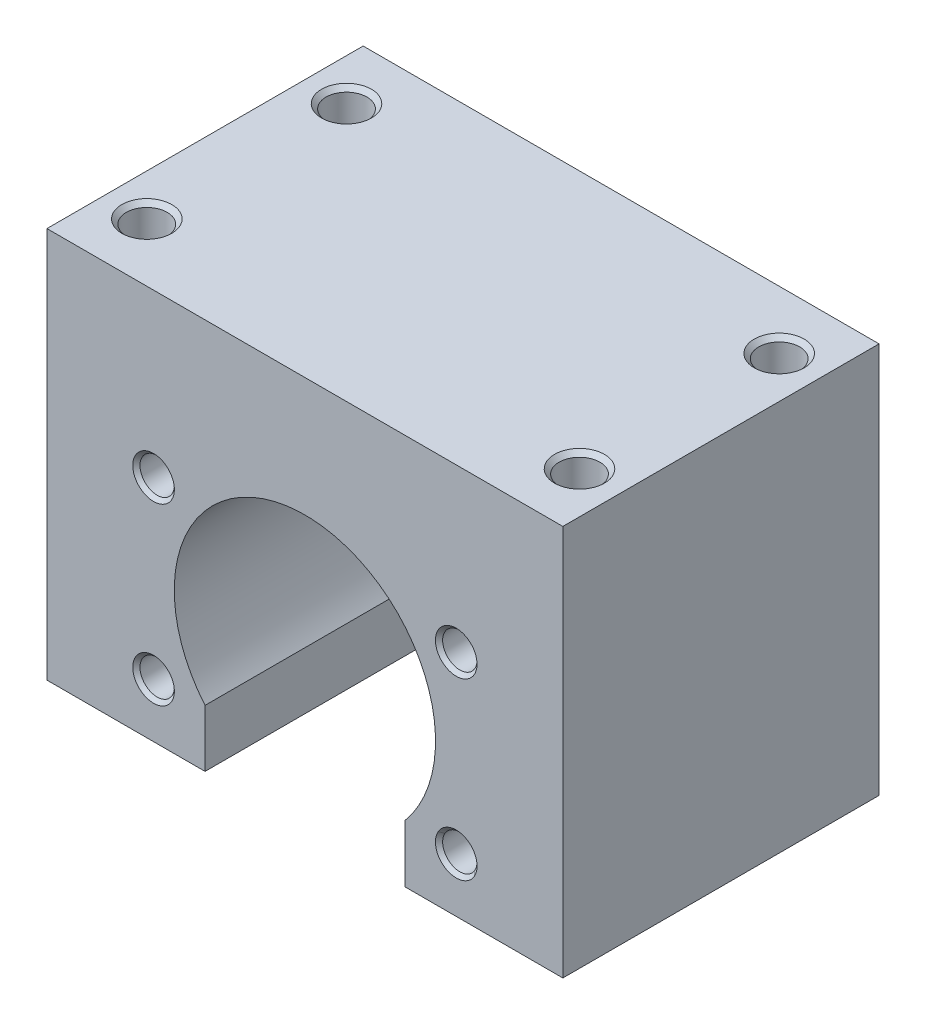
ISO-10303-21;
HEADER;
FILE_DESCRIPTION(('STEP AP214'),'2;1');
FILE_NAME('part.step','',(''),(''),'','','');
FILE_SCHEMA(('AUTOMOTIVE_DESIGN { 1 0 10303 214 1 1 1 1 }'));
ENDSEC;
DATA;
#1=APPLICATION_CONTEXT('core data for automotive mechanical design processes');
#2=APPLICATION_PROTOCOL_DEFINITION('international standard','automotive_design',2000,#1);
#3=PRODUCT_CONTEXT('',#1,'mechanical');
#4=PRODUCT('Part','Part','',(#3));
#5=PRODUCT_RELATED_PRODUCT_CATEGORY('part','',(#4));
#6=PRODUCT_DEFINITION_FORMATION('','',#4);
#7=PRODUCT_DEFINITION_CONTEXT('part definition',#1,'design');
#8=PRODUCT_DEFINITION('design','',#6,#7);
#9=PRODUCT_DEFINITION_SHAPE('','',#8);
#10=(LENGTH_UNIT() NAMED_UNIT(*) SI_UNIT(.MILLI.,.METRE.));
#11=(NAMED_UNIT(*) PLANE_ANGLE_UNIT() SI_UNIT($,.RADIAN.));
#12=(NAMED_UNIT(*) SI_UNIT($,.STERADIAN.) SOLID_ANGLE_UNIT());
#13=UNCERTAINTY_MEASURE_WITH_UNIT(LENGTH_MEASURE(1.E-05),#10,'distance_accuracy_value','');
#14=(GEOMETRIC_REPRESENTATION_CONTEXT(3) GLOBAL_UNCERTAINTY_ASSIGNED_CONTEXT((#13)) GLOBAL_UNIT_ASSIGNED_CONTEXT((#10,
#11,#12)) REPRESENTATION_CONTEXT('',''));
#15=CARTESIAN_POINT('',(0.,0.,0.));
#16=DIRECTION('',(0.,0.,1.));
#17=DIRECTION('',(1.,0.,0.));
#18=AXIS2_PLACEMENT_3D('',#15,#16,#17);
#19=CARTESIAN_POINT('',(18.1865334794732,10.5,10.599999999954));
#20=DIRECTION('',(0.,0.,1.));
#21=DIRECTION('',(1.,0.,0.));
#22=AXIS2_PLACEMENT_3D('',#19,#20,#21);
#23=CONICAL_SURFACE('',#22,2.06699999997618,1.04719755119477);
#24=CARTESIAN_POINT('',(18.1865334794732,10.5,9.40661699360135));
#25=VERTEX_POINT('',#24);
#26=VERTEX_LOOP('',#25);
#27=FACE_BOUND('',#26,.T.);
#28=CARTESIAN_POINT('',(18.1865334794732,10.5,10.6));
#29=DIRECTION('',(0.,0.,-1.));
#30=DIRECTION('',(-1.,0.,0.));
#31=AXIS2_PLACEMENT_3D('',#28,#29,#30);
#32=CIRCLE('',#31,2.067);
#33=CARTESIAN_POINT('',(16.1195334794732,10.5,10.6));
#34=VERTEX_POINT('',#33);
#35=EDGE_CURVE('E262',#34,#34,#32,.F.);
#36=ORIENTED_EDGE('',*,*,#35,.T.);
#37=EDGE_LOOP('',(#36));
#38=FACE_BOUND('',#37,.T.);
#39=ADVANCED_FACE('F16',(#27,#38),#23,.F.);
#40=CARTESIAN_POINT('',(-18.1865334794732,-10.5,10.599999999954));
#41=DIRECTION('',(0.,0.,1.));
#42=DIRECTION('',(1.,0.,0.));
#43=AXIS2_PLACEMENT_3D('',#40,#41,#42);
#44=CONICAL_SURFACE('',#43,2.06699999999424,1.04719755119452);
#45=CARTESIAN_POINT('',(-18.1865334794732,-10.5,9.40661699360135));
#46=VERTEX_POINT('',#45);
#47=VERTEX_LOOP('',#46);
#48=FACE_BOUND('',#47,.T.);
#49=CARTESIAN_POINT('',(-18.1865334794732,-10.5,10.6));
#50=DIRECTION('',(0.,0.,-1.));
#51=DIRECTION('',(-1.,0.,0.));
#52=AXIS2_PLACEMENT_3D('',#49,#50,#51);
#53=CIRCLE('',#52,2.067);
#54=CARTESIAN_POINT('',(-20.2535334794732,-10.5,10.6));
#55=VERTEX_POINT('',#54);
#56=EDGE_CURVE('E259',#55,#55,#53,.F.);
#57=ORIENTED_EDGE('',*,*,#56,.T.);
#58=EDGE_LOOP('',(#57));
#59=FACE_BOUND('',#58,.T.);
#60=ADVANCED_FACE('F310',(#48,#59),#44,.F.);
#61=CARTESIAN_POINT('',(18.1865334794732,-10.5,10.599999999954));
#62=DIRECTION('',(0.,0.,1.));
#63=DIRECTION('',(1.,0.,0.));
#64=AXIS2_PLACEMENT_3D('',#61,#62,#63);
#65=CONICAL_SURFACE('',#64,2.06699999997618,1.04719755119477);
#66=CARTESIAN_POINT('',(18.1865334794732,-10.5,9.40661699360135));
#67=VERTEX_POINT('',#66);
#68=VERTEX_LOOP('',#67);
#69=FACE_BOUND('',#68,.T.);
#70=CARTESIAN_POINT('',(18.1865334794732,-10.5,10.6));
#71=DIRECTION('',(0.,0.,-1.));
#72=DIRECTION('',(-1.,0.,0.));
#73=AXIS2_PLACEMENT_3D('',#70,#71,#72);
#74=CIRCLE('',#73,2.067);
#75=CARTESIAN_POINT('',(16.1195334794732,-10.5,10.6));
#76=VERTEX_POINT('',#75);
#77=EDGE_CURVE('E256',#76,#76,#74,.F.);
#78=ORIENTED_EDGE('',*,*,#77,.T.);
#79=EDGE_LOOP('',(#78));
#80=FACE_BOUND('',#79,.T.);
#81=ADVANCED_FACE('F316',(#69,#80),#65,.F.);
#82=CARTESIAN_POINT('',(-18.1865334794732,10.5,10.599999999954));
#83=DIRECTION('',(0.,0.,1.));
#84=DIRECTION('',(1.,0.,0.));
#85=AXIS2_PLACEMENT_3D('',#82,#83,#84);
#86=CONICAL_SURFACE('',#85,2.06699999999424,1.04719755119452);
#87=CARTESIAN_POINT('',(-18.1865334794732,10.5,9.40661699360135));
#88=VERTEX_POINT('',#87);
#89=VERTEX_LOOP('',#88);
#90=FACE_BOUND('',#89,.T.);
#91=CARTESIAN_POINT('',(-18.1865334794732,10.5,10.6));
#92=DIRECTION('',(0.,0.,-1.));
#93=DIRECTION('',(-1.,0.,0.));
#94=AXIS2_PLACEMENT_3D('',#91,#92,#93);
#95=CIRCLE('',#94,2.067);
#96=CARTESIAN_POINT('',(-20.2535334794732,10.5,10.6));
#97=VERTEX_POINT('',#96);
#98=EDGE_CURVE('E253',#97,#97,#95,.F.);
#99=ORIENTED_EDGE('',*,*,#98,.T.);
#100=EDGE_LOOP('',(#99));
#101=FACE_BOUND('',#100,.T.);
#102=ADVANCED_FACE('F426',(#90,#101),#86,.F.);
#103=CARTESIAN_POINT('',(26.,15.5999999999494,-12.));
#104=DIRECTION('',(0.,1.,0.));
#105=DIRECTION('',(-1.,0.,0.));
#106=AXIS2_PLACEMENT_3D('',#103,#104,#105);
#107=CONICAL_SURFACE('',#106,2.45849999998927,1.04719755111982);
#108=CARTESIAN_POINT('',(26.,14.1805843630607,-11.9999999999432));
#109=VERTEX_POINT('',#108);
#110=VERTEX_LOOP('',#109);
#111=FACE_BOUND('',#110,.T.);
#112=CARTESIAN_POINT('',(26.,15.6,-12.));
#113=DIRECTION('',(0.,-1.,0.));
#114=DIRECTION('',(0.,0.,-1.));
#115=AXIS2_PLACEMENT_3D('',#112,#113,#114);
#116=CIRCLE('',#115,2.4585);
#117=CARTESIAN_POINT('',(26.,15.6,-14.4585));
#118=VERTEX_POINT('',#117);
#119=EDGE_CURVE('E250',#118,#118,#116,.F.);
#120=ORIENTED_EDGE('',*,*,#119,.T.);
#121=EDGE_LOOP('',(#120));
#122=FACE_BOUND('',#121,.T.);
#123=ADVANCED_FACE('F422',(#111,#122),#107,.F.);
#124=CARTESIAN_POINT('',(26.,15.5999999999494,12.));
#125=DIRECTION('',(0.,1.,0.));
#126=DIRECTION('',(-1.,0.,0.));
#127=AXIS2_PLACEMENT_3D('',#124,#125,#126);
#128=CONICAL_SURFACE('',#127,2.45849999998927,1.04719755111982);
#129=CARTESIAN_POINT('',(26.,14.1805843630607,11.9999999999432));
#130=VERTEX_POINT('',#129);
#131=VERTEX_LOOP('',#130);
#132=FACE_BOUND('',#131,.T.);
#133=CARTESIAN_POINT('',(26.,15.6,12.));
#134=DIRECTION('',(0.,1.,0.));
#135=DIRECTION('',(0.,0.,1.));
#136=AXIS2_PLACEMENT_3D('',#133,#134,#135);
#137=CIRCLE('',#136,2.4585);
#138=CARTESIAN_POINT('',(26.,15.6,14.4585));
#139=VERTEX_POINT('',#138);
#140=EDGE_CURVE('E247',#139,#139,#137,.T.);
#141=ORIENTED_EDGE('',*,*,#140,.T.);
#142=EDGE_LOOP('',(#141));
#143=FACE_BOUND('',#142,.T.);
#144=ADVANCED_FACE('F418',(#132,#143),#128,.F.);
#145=CARTESIAN_POINT('',(-26.,15.5999999999494,-12.));
#146=DIRECTION('',(0.,1.,0.));
#147=DIRECTION('',(-1.,0.,0.));
#148=AXIS2_PLACEMENT_3D('',#145,#146,#147);
#149=CONICAL_SURFACE('',#148,2.45849999998927,1.04719755111982);
#150=CARTESIAN_POINT('',(-26.,14.1805843630607,-11.9999999999432));
#151=VERTEX_POINT('',#150);
#152=VERTEX_LOOP('',#151);
#153=FACE_BOUND('',#152,.T.);
#154=CARTESIAN_POINT('',(-26.,15.6,-12.));
#155=DIRECTION('',(0.,-1.,0.));
#156=DIRECTION('',(0.,0.,-1.));
#157=AXIS2_PLACEMENT_3D('',#154,#155,#156);
#158=CIRCLE('',#157,2.4585);
#159=CARTESIAN_POINT('',(-26.,15.6,-14.4585));
#160=VERTEX_POINT('',#159);
#161=EDGE_CURVE('E244',#160,#160,#158,.F.);
#162=ORIENTED_EDGE('',*,*,#161,.T.);
#163=EDGE_LOOP('',(#162));
#164=FACE_BOUND('',#163,.T.);
#165=ADVANCED_FACE('F414',(#153,#164),#149,.F.);
#166=CARTESIAN_POINT('',(-26.,15.5999999999494,12.));
#167=DIRECTION('',(0.,1.,0.));
#168=DIRECTION('',(-1.,0.,0.));
#169=AXIS2_PLACEMENT_3D('',#166,#167,#168);
#170=CONICAL_SURFACE('',#169,2.45849999998927,1.04719755111982);
#171=CARTESIAN_POINT('',(-26.,14.1805843630607,11.9999999999432));
#172=VERTEX_POINT('',#171);
#173=VERTEX_LOOP('',#172);
#174=FACE_BOUND('',#173,.T.);
#175=CARTESIAN_POINT('',(-26.,15.6,12.));
#176=DIRECTION('',(0.,1.,0.));
#177=DIRECTION('',(0.,0.,1.));
#178=AXIS2_PLACEMENT_3D('',#175,#176,#177);
#179=CIRCLE('',#178,2.4585);
#180=CARTESIAN_POINT('',(-26.,15.6,14.4585));
#181=VERTEX_POINT('',#180);
#182=EDGE_CURVE('E241',#181,#181,#179,.T.);
#183=ORIENTED_EDGE('',*,*,#182,.T.);
#184=EDGE_LOOP('',(#183));
#185=FACE_BOUND('',#184,.T.);
#186=ADVANCED_FACE('F305',(#174,#185),#170,.F.);
#187=CARTESIAN_POINT('',(18.1865334794732,10.5,14.5835));
#188=DIRECTION('',(0.,0.,-1.));
#189=DIRECTION('',(-1.,0.,0.));
#190=AXIS2_PLACEMENT_3D('',#187,#188,#189);
#191=CYLINDRICAL_SURFACE('',#190,2.067);
#192=CARTESIAN_POINT('',(18.1865334794732,10.5,18.5670000000187));
#193=DIRECTION('',(0.,0.,1.));
#194=DIRECTION('',(-0.866025403780619,-0.500000000006616,0.));
#195=AXIS2_PLACEMENT_3D('',#192,#193,#194);
#196=CIRCLE('',#195,2.06700000002541);
#197=CARTESIAN_POINT('',(16.3964589698367,9.46649999997362,18.5670000000187));
#198=VERTEX_POINT('',#197);
#199=EDGE_CURVE('E238',#198,#198,#196,.T.);
#200=ORIENTED_EDGE('',*,*,#199,.T.);
#201=EDGE_LOOP('',(#200));
#202=FACE_BOUND('',#201,.T.);
#203=ORIENTED_EDGE('',*,*,#35,.F.);
#204=EDGE_LOOP('',(#203));
#205=FACE_BOUND('',#204,.T.);
#206=ADVANCED_FACE('F301',(#202,#205),#191,.F.);
#207=CARTESIAN_POINT('',(-18.1865334794732,-10.5,14.5835));
#208=DIRECTION('',(0.,0.,-1.));
#209=DIRECTION('',(-1.,0.,0.));
#210=AXIS2_PLACEMENT_3D('',#207,#208,#209);
#211=CYLINDRICAL_SURFACE('',#210,2.067);
#212=CARTESIAN_POINT('',(-18.1865334794732,-10.5,18.5669999999618));
#213=DIRECTION('',(0.,0.,1.));
#214=DIRECTION('',(-0.866025403790857,-0.499999999988883,0.));
#215=AXIS2_PLACEMENT_3D('',#212,#213,#214);
#216=CIRCLE('',#215,2.06700000001504);
#217=CARTESIAN_POINT('',(-19.9766079891219,-11.5334999999845,18.5669999999618));
#218=VERTEX_POINT('',#217);
#219=EDGE_CURVE('E230',#218,#218,#216,.T.);
#220=ORIENTED_EDGE('',*,*,#219,.T.);
#221=EDGE_LOOP('',(#220));
#222=FACE_BOUND('',#221,.T.);
#223=ORIENTED_EDGE('',*,*,#56,.F.);
#224=EDGE_LOOP('',(#223));
#225=FACE_BOUND('',#224,.T.);
#226=ADVANCED_FACE('F304',(#222,#225),#211,.F.);
#227=CARTESIAN_POINT('',(18.1865334794732,-10.5,14.5835));
#228=DIRECTION('',(0.,0.,-1.));
#229=DIRECTION('',(-1.,0.,0.));
#230=AXIS2_PLACEMENT_3D('',#227,#228,#229);
#231=CYLINDRICAL_SURFACE('',#230,2.067);
#232=CARTESIAN_POINT('',(18.1865334794732,-10.5,18.5670000000187));
#233=DIRECTION('',(0.,0.,1.));
#234=DIRECTION('',(-0.866025403786573,0.499999999996303,0.));
#235=AXIS2_PLACEMENT_3D('',#232,#233,#234);
#236=CIRCLE('',#235,2.0670000000112);
#237=CARTESIAN_POINT('',(16.3964589698402,-9.46650000000153,18.567000000014));
#238=VERTEX_POINT('',#237);
#239=CARTESIAN_POINT('',(19.9766079891084,-11.5335000000037,18.567000000014));
#240=VERTEX_POINT('',#239);
#241=EDGE_CURVE('E191',#238,#240,#236,.T.);
#242=ORIENTED_EDGE('',*,*,#241,.T.);
#243=CARTESIAN_POINT('',(18.1865334794732,-10.5,18.5670000000187));
#244=DIRECTION('',(0.,0.,1.));
#245=DIRECTION('',(-0.866025403786573,0.499999999996303,0.));
#246=AXIS2_PLACEMENT_3D('',#243,#244,#245);
#247=CIRCLE('',#246,2.0670000000112);
#248=EDGE_CURVE('E228',#240,#238,#247,.T.);
#249=ORIENTED_EDGE('',*,*,#248,.T.);
#250=EDGE_LOOP('',(#242,#249));
#251=FACE_BOUND('',#250,.T.);
#252=ORIENTED_EDGE('',*,*,#77,.F.);
#253=EDGE_LOOP('',(#252));
#254=FACE_BOUND('',#253,.T.);
#255=ADVANCED_FACE('F404',(#251,#254),#231,.F.);
#256=CARTESIAN_POINT('',(-18.1865334794732,10.5,14.5835));
#257=DIRECTION('',(0.,0.,-1.));
#258=DIRECTION('',(-1.,0.,0.));
#259=AXIS2_PLACEMENT_3D('',#256,#257,#258);
#260=CYLINDRICAL_SURFACE('',#259,2.067);
#261=CARTESIAN_POINT('',(-18.1865334794732,10.5,18.5669999999618));
#262=DIRECTION('',(0.,0.,1.));
#263=DIRECTION('',(-0.866025403790857,0.499999999988883,0.));
#264=AXIS2_PLACEMENT_3D('',#261,#262,#263);
#265=CIRCLE('',#264,2.06700000001504);
#266=CARTESIAN_POINT('',(-19.9766079891219,11.5334999999845,18.5669999999618));
#267=VERTEX_POINT('',#266);
#268=EDGE_CURVE('E168',#267,#267,#265,.T.);
#269=ORIENTED_EDGE('',*,*,#268,.T.);
#270=EDGE_LOOP('',(#269));
#271=FACE_BOUND('',#270,.T.);
#272=ORIENTED_EDGE('',*,*,#98,.F.);
#273=EDGE_LOOP('',(#272));
#274=FACE_BOUND('',#273,.T.);
#275=ADVANCED_FACE('F400',(#271,#274),#260,.F.);
#276=CARTESIAN_POINT('',(26.,22.52925,-12.));
#277=DIRECTION('',(0.,-1.,0.));
#278=DIRECTION('',(0.,0.,-1.));
#279=AXIS2_PLACEMENT_3D('',#276,#277,#278);
#280=CYLINDRICAL_SURFACE('',#279,2.4585);
#281=CARTESIAN_POINT('',(26.,29.4585000000325,-12.));
#282=DIRECTION('',(0.,1.,0.));
#283=DIRECTION('',(0.,0.,-1.));
#284=AXIS2_PLACEMENT_3D('',#281,#282,#283);
#285=CIRCLE('',#284,2.45850000004611);
#286=CARTESIAN_POINT('',(26.,29.4585000000325,-14.4585000000461));
#287=VERTEX_POINT('',#286);
#288=EDGE_CURVE('E164',#287,#287,#285,.T.);
#289=ORIENTED_EDGE('',*,*,#288,.T.);
#290=EDGE_LOOP('',(#289));
#291=FACE_BOUND('',#290,.T.);
#292=ORIENTED_EDGE('',*,*,#119,.F.);
#293=EDGE_LOOP('',(#292));
#294=FACE_BOUND('',#293,.T.);
#295=ADVANCED_FACE('F396',(#291,#294),#280,.F.);
#296=CARTESIAN_POINT('',(26.,22.52925,12.));
#297=DIRECTION('',(0.,1.,0.));
#298=DIRECTION('',(0.,0.,1.));
#299=AXIS2_PLACEMENT_3D('',#296,#297,#298);
#300=CYLINDRICAL_SURFACE('',#299,2.4585);
#301=CARTESIAN_POINT('',(26.,29.4585000000325,12.));
#302=DIRECTION('',(0.,1.,0.));
#303=DIRECTION('',(0.,0.,1.));
#304=AXIS2_PLACEMENT_3D('',#301,#302,#303);
#305=CIRCLE('',#304,2.45850000004611);
#306=CARTESIAN_POINT('',(26.,29.4585000000325,14.4585000000461));
#307=VERTEX_POINT('',#306);
#308=EDGE_CURVE('E221',#307,#307,#305,.T.);
#309=ORIENTED_EDGE('',*,*,#308,.T.);
#310=EDGE_LOOP('',(#309));
#311=FACE_BOUND('',#310,.T.);
#312=ORIENTED_EDGE('',*,*,#140,.F.);
#313=EDGE_LOOP('',(#312));
#314=FACE_BOUND('',#313,.T.);
#315=ADVANCED_FACE('F392',(#311,#314),#300,.F.);
#316=CARTESIAN_POINT('',(-26.,22.52925,-12.));
#317=DIRECTION('',(0.,-1.,0.));
#318=DIRECTION('',(0.,0.,-1.));
#319=AXIS2_PLACEMENT_3D('',#316,#317,#318);
#320=CYLINDRICAL_SURFACE('',#319,2.4585);
#321=CARTESIAN_POINT('',(-26.,29.4585000000325,-12.));
#322=DIRECTION('',(0.,1.,0.));
#323=DIRECTION('',(0.,0.,-1.));
#324=AXIS2_PLACEMENT_3D('',#321,#322,#323);
#325=CIRCLE('',#324,2.45850000004611);
#326=CARTESIAN_POINT('',(-26.,29.4585000000325,-14.4585000000461));
#327=VERTEX_POINT('',#326);
#328=EDGE_CURVE('E218',#327,#327,#325,.T.);
#329=ORIENTED_EDGE('',*,*,#328,.T.);
#330=EDGE_LOOP('',(#329));
#331=FACE_BOUND('',#330,.T.);
#332=ORIENTED_EDGE('',*,*,#161,.F.);
#333=EDGE_LOOP('',(#332));
#334=FACE_BOUND('',#333,.T.);
#335=ADVANCED_FACE('F388',(#331,#334),#320,.F.);
#336=CARTESIAN_POINT('',(-26.,22.52925,12.));
#337=DIRECTION('',(0.,1.,0.));
#338=DIRECTION('',(0.,0.,1.));
#339=AXIS2_PLACEMENT_3D('',#336,#337,#338);
#340=CYLINDRICAL_SURFACE('',#339,2.4585);
#341=CARTESIAN_POINT('',(-26.,29.4585000000325,12.));
#342=DIRECTION('',(0.,1.,0.));
#343=DIRECTION('',(0.,0.,1.));
#344=AXIS2_PLACEMENT_3D('',#341,#342,#343);
#345=CIRCLE('',#344,2.45850000004611);
#346=CARTESIAN_POINT('',(-26.,29.4585000000325,14.4585000000461));
#347=VERTEX_POINT('',#346);
#348=EDGE_CURVE('E123',#347,#347,#345,.T.);
#349=ORIENTED_EDGE('',*,*,#348,.T.);
#350=EDGE_LOOP('',(#349));
#351=FACE_BOUND('',#350,.T.);
#352=ORIENTED_EDGE('',*,*,#182,.F.);
#353=EDGE_LOOP('',(#352));
#354=FACE_BOUND('',#353,.T.);
#355=ADVANCED_FACE('F297',(#351,#354),#340,.F.);
#356=CARTESIAN_POINT('',(18.1865334794732,10.5,18.9999999998918));
#357=DIRECTION('',(0.,0.,1.));
#358=DIRECTION('',(1.,0.,0.));
#359=AXIS2_PLACEMENT_3D('',#356,#357,#358);
#360=CONICAL_SURFACE('',#359,2.49999999989228,0.785398163414265);
#361=CARTESIAN_POINT('',(18.1865334794732,10.5,18.9999999999694));
#362=DIRECTION('',(0.,0.,1.));
#363=DIRECTION('',(1.,0.,0.));
#364=AXIS2_PLACEMENT_3D('',#361,#362,#363);
#365=CIRCLE('',#364,2.49999999996993);
#366=CARTESIAN_POINT('',(20.6865334794431,10.5,18.9999999999694));
#367=VERTEX_POINT('',#366);
#368=EDGE_CURVE('E180',#367,#367,#365,.F.);
#369=ORIENTED_EDGE('',*,*,#368,.F.);
#370=EDGE_LOOP('',(#369));
#371=FACE_BOUND('',#370,.T.);
#372=ORIENTED_EDGE('',*,*,#199,.F.);
#373=EDGE_LOOP('',(#372));
#374=FACE_BOUND('',#373,.T.);
#375=ADVANCED_FACE('F293',(#371,#374),#360,.F.);
#376=CARTESIAN_POINT('',(-18.1865334794732,-10.5,18.9999999999486));
#377=DIRECTION('',(0.,0.,1.));
#378=DIRECTION('',(1.,0.,0.));
#379=AXIS2_PLACEMENT_3D('',#376,#377,#378);
#380=CONICAL_SURFACE('',#379,2.49999999991034,0.785398163380267);
#381=CARTESIAN_POINT('',(-18.1865334794732,-10.5,19.0000000000055));
#382=DIRECTION('',(0.,0.,1.));
#383=DIRECTION('',(1.,0.,0.));
#384=AXIS2_PLACEMENT_3D('',#381,#382,#383);
#385=CIRCLE('',#384,2.49999999996718);
#386=CARTESIAN_POINT('',(-15.686533479506,-10.5,19.0000000000055));
#387=VERTEX_POINT('',#386);
#388=EDGE_CURVE('E286',#387,#387,#385,.F.);
#389=ORIENTED_EDGE('',*,*,#388,.F.);
#390=EDGE_LOOP('',(#389));
#391=FACE_BOUND('',#390,.T.);
#392=ORIENTED_EDGE('',*,*,#219,.F.);
#393=EDGE_LOOP('',(#392));
#394=FACE_BOUND('',#393,.T.);
#395=ADVANCED_FACE('F296',(#391,#394),#380,.F.);
#396=CARTESIAN_POINT('',(18.1865334794732,-10.5,19.0000000000623));
#397=DIRECTION('',(0.,0.,1.));
#398=DIRECTION('',(1.,0.,0.));
#399=AXIS2_PLACEMENT_3D('',#396,#397,#398);
#400=CONICAL_SURFACE('',#399,2.50000000003337,0.785398163372651);
#401=ORIENTED_EDGE('',*,*,#248,.F.);
#402=DIRECTION('',(-0.612372435694274,0.353553390595904,-0.707106781186549));
#403=VECTOR('',#402,1.);
#404=CARTESIAN_POINT('',(432150.573601678,-249502.250001855,499000.));
#405=LINE('',#404,#403);
#406=CARTESIAN_POINT('',(20.351596988911,-11.7499999999827,19.0000000000055));
#407=VERTEX_POINT('',#406);
#408=EDGE_CURVE('E188',#240,#407,#405,.F.);
#409=ORIENTED_EDGE('',*,*,#408,.T.);
#410=CARTESIAN_POINT('',(18.1865334794732,-10.5,19.0000000000623));
#411=DIRECTION('',(0.,0.,1.));
#412=DIRECTION('',(1.,0.,0.));
#413=AXIS2_PLACEMENT_3D('',#410,#411,#412);
#414=CIRCLE('',#413,2.50000000003337);
#415=CARTESIAN_POINT('',(16.0214699700073,-9.25000000000114,19.0000000000055));
#416=VERTEX_POINT('',#415);
#417=EDGE_CURVE('E283',#416,#407,#414,.F.);
#418=ORIENTED_EDGE('',*,*,#417,.F.);
#419=DIRECTION('',(0.612372435695786,-0.353553390593284,-0.707106781186549));
#420=VECTOR('',#419,1.);
#421=CARTESIAN_POINT('',(-432114.200535786,249481.250000007,499000.));
#422=LINE('',#421,#420);
#423=EDGE_CURVE('E190',#416,#238,#422,.T.);
#424=ORIENTED_EDGE('',*,*,#423,.T.);
#425=EDGE_LOOP('',(#401,#409,#418,#424));
#426=FACE_BOUND('',#425,.T.);
#427=ADVANCED_FACE('F378',(#426),#400,.F.);
#428=CARTESIAN_POINT('',(18.1865334794732,-10.5,18.9999999998918));
#429=DIRECTION('',(0.,0.,1.));
#430=DIRECTION('',(1.,0.,0.));
#431=AXIS2_PLACEMENT_3D('',#428,#429,#430);
#432=CONICAL_SURFACE('',#431,2.49999999984306,0.785398163349804);
#433=CARTESIAN_POINT('',(18.1865334794732,-10.5,18.9999999999486));
#434=DIRECTION('',(0.,0.,1.));
#435=DIRECTION('',(1.,0.,0.));
#436=AXIS2_PLACEMENT_3D('',#433,#434,#435);
#437=CIRCLE('',#436,2.4999999998999);
#438=EDGE_CURVE('E280',#407,#416,#437,.F.);
#439=ORIENTED_EDGE('',*,*,#438,.F.);
#440=ORIENTED_EDGE('',*,*,#408,.F.);
#441=ORIENTED_EDGE('',*,*,#241,.F.);
#442=ORIENTED_EDGE('',*,*,#423,.F.);
#443=EDGE_LOOP('',(#439,#440,#441,#442));
#444=FACE_BOUND('',#443,.T.);
#445=ADVANCED_FACE('F374',(#444),#432,.F.);
#446=CARTESIAN_POINT('',(-18.1865334794732,10.5,18.9999999999486));
#447=DIRECTION('',(0.,0.,1.));
#448=DIRECTION('',(1.,0.,0.));
#449=AXIS2_PLACEMENT_3D('',#446,#447,#448);
#450=CONICAL_SURFACE('',#449,2.49999999991034,0.785398163380267);
#451=CARTESIAN_POINT('',(-18.1865334794732,10.5,19.0000000000055));
#452=DIRECTION('',(0.,0.,1.));
#453=DIRECTION('',(1.,0.,0.));
#454=AXIS2_PLACEMENT_3D('',#451,#452,#453);
#455=CIRCLE('',#454,2.49999999996718);
#456=CARTESIAN_POINT('',(-15.686533479506,10.5,19.0000000000055));
#457=VERTEX_POINT('',#456);
#458=EDGE_CURVE('E175',#457,#457,#455,.F.);
#459=ORIENTED_EDGE('',*,*,#458,.F.);
#460=EDGE_LOOP('',(#459));
#461=FACE_BOUND('',#460,.T.);
#462=ORIENTED_EDGE('',*,*,#268,.F.);
#463=EDGE_LOOP('',(#462));
#464=FACE_BOUND('',#463,.T.);
#465=ADVANCED_FACE('F370',(#461,#464),#450,.F.);
#466=CARTESIAN_POINT('',(-31.,-17.,19.));
#467=DIRECTION('',(0.,-1.,0.));
#468=DIRECTION('',(0.,0.,-1.));
#469=AXIS2_PLACEMENT_3D('',#466,#467,#468);
#470=PLANE('',#469);
#471=DIRECTION('',(1.,0.,0.));
#472=VECTOR('',#471,1.);
#473=CARTESIAN_POINT('',(0.,-17.,19.));
#474=LINE('',#473,#472);
#475=CARTESIAN_POINT('',(-31.,-17.,19.));
#476=VERTEX_POINT('',#475);
#477=CARTESIAN_POINT('',(-12.,-17.,19.));
#478=VERTEX_POINT('',#477);
#479=EDGE_CURVE('E171',#476,#478,#474,.T.);
#480=ORIENTED_EDGE('',*,*,#479,.F.);
#481=DIRECTION('',(0.,0.,1.));
#482=VECTOR('',#481,1.);
#483=CARTESIAN_POINT('',(-31.,-17.,19.));
#484=LINE('',#483,#482);
#485=CARTESIAN_POINT('',(-31.,-17.,-19.));
#486=VERTEX_POINT('',#485);
#487=EDGE_CURVE('E141',#486,#476,#484,.T.);
#488=ORIENTED_EDGE('',*,*,#487,.F.);
#489=DIRECTION('',(1.,0.,0.));
#490=VECTOR('',#489,1.);
#491=CARTESIAN_POINT('',(0.,-17.,-19.));
#492=LINE('',#491,#490);
#493=CARTESIAN_POINT('',(-12.,-17.,-19.));
#494=VERTEX_POINT('',#493);
#495=EDGE_CURVE('E138',#486,#494,#492,.T.);
#496=ORIENTED_EDGE('',*,*,#495,.T.);
#497=DIRECTION('',(0.,0.,-1.));
#498=VECTOR('',#497,1.);
#499=CARTESIAN_POINT('',(-12.,-17.,19.));
#500=LINE('',#499,#498);
#501=EDGE_CURVE('E133',#478,#494,#500,.T.);
#502=ORIENTED_EDGE('',*,*,#501,.F.);
#503=EDGE_LOOP('',(#480,#488,#496,#502));
#504=FACE_BOUND('',#503,.T.);
#505=ADVANCED_FACE('F367',(#504),#470,.T.);
#506=CARTESIAN_POINT('',(-12.,-17.,19.));
#507=DIRECTION('',(1.,0.,0.));
#508=DIRECTION('',(0.,0.,-1.));
#509=AXIS2_PLACEMENT_3D('',#506,#507,#508);
#510=PLANE('',#509);
#511=DIRECTION('',(0.,1.,0.));
#512=VECTOR('',#511,1.);
#513=CARTESIAN_POINT('',(-12.,0.,19.));
#514=LINE('',#513,#512);
#515=CARTESIAN_POINT('',(-12.,-10.1237344888139,19.));
#516=VERTEX_POINT('',#515);
#517=EDGE_CURVE('E174',#478,#516,#514,.T.);
#518=ORIENTED_EDGE('',*,*,#517,.F.);
#519=ORIENTED_EDGE('',*,*,#501,.T.);
#520=DIRECTION('',(0.,1.,0.));
#521=VECTOR('',#520,1.);
#522=CARTESIAN_POINT('',(-12.,0.,-19.));
#523=LINE('',#522,#521);
#524=CARTESIAN_POINT('',(-12.,-10.1237344888139,-19.));
#525=VERTEX_POINT('',#524);
#526=EDGE_CURVE('E120',#494,#525,#523,.T.);
#527=ORIENTED_EDGE('',*,*,#526,.T.);
#528=DIRECTION('',(0.,0.,1.));
#529=VECTOR('',#528,1.);
#530=CARTESIAN_POINT('',(-12.,-10.1237344888139,19.));
#531=LINE('',#530,#529);
#532=EDGE_CURVE('E125',#525,#516,#531,.T.);
#533=ORIENTED_EDGE('',*,*,#532,.T.);
#534=EDGE_LOOP('',(#518,#519,#527,#533));
#535=FACE_BOUND('',#534,.T.);
#536=ADVANCED_FACE('F136',(#535),#510,.T.);
#537=CARTESIAN_POINT('',(0.,0.,19.));
#538=DIRECTION('',(0.,0.,1.));
#539=DIRECTION('',(1.,0.,0.));
#540=AXIS2_PLACEMENT_3D('',#537,#538,#539);
#541=CYLINDRICAL_SURFACE('',#540,15.7);
#542=CARTESIAN_POINT('',(0.,0.,-19.));
#543=DIRECTION('',(0.,0.,1.));
#544=DIRECTION('',(1.,0.,0.));
#545=AXIS2_PLACEMENT_3D('',#542,#543,#544);
#546=CIRCLE('',#545,15.7);
#547=CARTESIAN_POINT('',(12.,-10.1237344888139,-19.));
#548=VERTEX_POINT('',#547);
#549=EDGE_CURVE('E19',#525,#548,#546,.F.);
#550=ORIENTED_EDGE('',*,*,#549,.T.);
#551=DIRECTION('',(0.,0.,1.));
#552=VECTOR('',#551,1.);
#553=CARTESIAN_POINT('',(12.,-10.1237344888139,19.));
#554=LINE('',#553,#552);
#555=CARTESIAN_POINT('',(12.,-10.1237344888139,19.));
#556=VERTEX_POINT('',#555);
#557=EDGE_CURVE('E132',#556,#548,#554,.F.);
#558=ORIENTED_EDGE('',*,*,#557,.F.);
#559=CARTESIAN_POINT('',(0.,0.,19.));
#560=DIRECTION('',(0.,0.,1.));
#561=DIRECTION('',(1.,0.,0.));
#562=AXIS2_PLACEMENT_3D('',#559,#560,#561);
#563=CIRCLE('',#562,15.7);
#564=EDGE_CURVE('E128',#516,#556,#563,.F.);
#565=ORIENTED_EDGE('',*,*,#564,.F.);
#566=ORIENTED_EDGE('',*,*,#532,.F.);
#567=EDGE_LOOP('',(#550,#558,#565,#566));
#568=FACE_BOUND('',#567,.T.);
#569=ADVANCED_FACE('F126',(#568),#541,.F.);
#570=CARTESIAN_POINT('',(12.,-10.1237344888139,19.));
#571=DIRECTION('',(-1.,0.,0.));
#572=DIRECTION('',(0.,0.,1.));
#573=AXIS2_PLACEMENT_3D('',#570,#571,#572);
#574=PLANE('',#573);
#575=DIRECTION('',(0.,1.,0.));
#576=VECTOR('',#575,1.);
#577=CARTESIAN_POINT('',(12.,0.,19.));
#578=LINE('',#577,#576);
#579=CARTESIAN_POINT('',(12.,-17.,19.));
#580=VERTEX_POINT('',#579);
#581=EDGE_CURVE('E159',#556,#580,#578,.F.);
#582=ORIENTED_EDGE('',*,*,#581,.F.);
#583=ORIENTED_EDGE('',*,*,#557,.T.);
#584=DIRECTION('',(0.,1.,0.));
#585=VECTOR('',#584,1.);
#586=CARTESIAN_POINT('',(12.,0.,-19.));
#587=LINE('',#586,#585);
#588=CARTESIAN_POINT('',(12.,-17.,-19.));
#589=VERTEX_POINT('',#588);
#590=EDGE_CURVE('E122',#548,#589,#587,.F.);
#591=ORIENTED_EDGE('',*,*,#590,.T.);
#592=DIRECTION('',(0.,0.,-1.));
#593=VECTOR('',#592,1.);
#594=CARTESIAN_POINT('',(12.,-17.,19.));
#595=LINE('',#594,#593);
#596=EDGE_CURVE('E155',#580,#589,#595,.T.);
#597=ORIENTED_EDGE('',*,*,#596,.F.);
#598=EDGE_LOOP('',(#582,#583,#591,#597));
#599=FACE_BOUND('',#598,.T.);
#600=ADVANCED_FACE('F358',(#599),#574,.T.);
#601=CARTESIAN_POINT('',(12.,-17.,19.));
#602=DIRECTION('',(0.,-1.,0.));
#603=DIRECTION('',(0.,0.,-1.));
#604=AXIS2_PLACEMENT_3D('',#601,#602,#603);
#605=PLANE('',#604);
#606=DIRECTION('',(1.,0.,0.));
#607=VECTOR('',#606,1.);
#608=CARTESIAN_POINT('',(0.,-17.,19.));
#609=LINE('',#608,#607);
#610=CARTESIAN_POINT('',(31.,-17.,19.));
#611=VERTEX_POINT('',#610);
#612=EDGE_CURVE('E156',#580,#611,#609,.T.);
#613=ORIENTED_EDGE('',*,*,#612,.F.);
#614=ORIENTED_EDGE('',*,*,#596,.T.);
#615=DIRECTION('',(1.,0.,0.));
#616=VECTOR('',#615,1.);
#617=CARTESIAN_POINT('',(0.,-17.,-19.));
#618=LINE('',#617,#616);
#619=CARTESIAN_POINT('',(31.,-17.,-19.));
#620=VERTEX_POINT('',#619);
#621=EDGE_CURVE('E143',#589,#620,#618,.T.);
#622=ORIENTED_EDGE('',*,*,#621,.T.);
#623=DIRECTION('',(0.,0.,-1.));
#624=VECTOR('',#623,1.);
#625=CARTESIAN_POINT('',(31.,-17.,19.));
#626=LINE('',#625,#624);
#627=EDGE_CURVE('E276',#611,#620,#626,.T.);
#628=ORIENTED_EDGE('',*,*,#627,.F.);
#629=EDGE_LOOP('',(#613,#614,#622,#628));
#630=FACE_BOUND('',#629,.T.);
#631=ADVANCED_FACE('F354',(#630),#605,.T.);
#632=CARTESIAN_POINT('',(26.,29.9999999999159,-12.));
#633=DIRECTION('',(0.,1.,0.));
#634=DIRECTION('',(0.,0.,1.));
#635=AXIS2_PLACEMENT_3D('',#632,#633,#634);
#636=CONICAL_SURFACE('',#635,2.99999999992951,0.785398163397448);
#637=CARTESIAN_POINT('',(26.,30.0000000000296,-12.));
#638=DIRECTION('',(0.,1.,0.));
#639=DIRECTION('',(0.,0.,1.));
#640=AXIS2_PLACEMENT_3D('',#637,#638,#639);
#641=CIRCLE('',#640,3.0000000000432);
#642=CARTESIAN_POINT('',(26.,30.0000000000296,-8.9999999999568));
#643=VERTEX_POINT('',#642);
#644=EDGE_CURVE('E273',#643,#643,#641,.F.);
#645=ORIENTED_EDGE('',*,*,#644,.F.);
#646=EDGE_LOOP('',(#645));
#647=FACE_BOUND('',#646,.T.);
#648=ORIENTED_EDGE('',*,*,#288,.F.);
#649=EDGE_LOOP('',(#648));
#650=FACE_BOUND('',#649,.T.);
#651=ADVANCED_FACE('F350',(#647,#650),#636,.F.);
#652=CARTESIAN_POINT('',(26.,29.9999999999159,12.));
#653=DIRECTION('',(0.,1.,0.));
#654=DIRECTION('',(0.,0.,1.));
#655=AXIS2_PLACEMENT_3D('',#652,#653,#654);
#656=CONICAL_SURFACE('',#655,2.99999999992951,0.785398163397448);
#657=CARTESIAN_POINT('',(26.,30.0000000000296,12.));
#658=DIRECTION('',(0.,1.,0.));
#659=DIRECTION('',(0.,0.,1.));
#660=AXIS2_PLACEMENT_3D('',#657,#658,#659);
#661=CIRCLE('',#660,3.0000000000432);
#662=CARTESIAN_POINT('',(26.,30.0000000000296,15.0000000000432));
#663=VERTEX_POINT('',#662);
#664=EDGE_CURVE('E270',#663,#663,#661,.F.);
#665=ORIENTED_EDGE('',*,*,#664,.F.);
#666=EDGE_LOOP('',(#665));
#667=FACE_BOUND('',#666,.T.);
#668=ORIENTED_EDGE('',*,*,#308,.F.);
#669=EDGE_LOOP('',(#668));
#670=FACE_BOUND('',#669,.T.);
#671=ADVANCED_FACE('F346',(#667,#670),#656,.F.);
#672=CARTESIAN_POINT('',(-26.,29.9999999999159,-12.));
#673=DIRECTION('',(0.,1.,0.));
#674=DIRECTION('',(0.,0.,1.));
#675=AXIS2_PLACEMENT_3D('',#672,#673,#674);
#676=CONICAL_SURFACE('',#675,2.99999999992951,0.785398163397448);
#677=CARTESIAN_POINT('',(-26.,30.0000000000296,-12.));
#678=DIRECTION('',(0.,1.,0.));
#679=DIRECTION('',(0.,0.,1.));
#680=AXIS2_PLACEMENT_3D('',#677,#678,#679);
#681=CIRCLE('',#680,3.0000000000432);
#682=CARTESIAN_POINT('',(-26.,30.0000000000296,-8.9999999999568));
#683=VERTEX_POINT('',#682);
#684=EDGE_CURVE('E267',#683,#683,#681,.F.);
#685=ORIENTED_EDGE('',*,*,#684,.F.);
#686=EDGE_LOOP('',(#685));
#687=FACE_BOUND('',#686,.T.);
#688=ORIENTED_EDGE('',*,*,#328,.F.);
#689=EDGE_LOOP('',(#688));
#690=FACE_BOUND('',#689,.T.);
#691=ADVANCED_FACE('F342',(#687,#690),#676,.F.);
#692=CARTESIAN_POINT('',(-26.,29.9999999999159,12.));
#693=DIRECTION('',(0.,1.,0.));
#694=DIRECTION('',(0.,0.,1.));
#695=AXIS2_PLACEMENT_3D('',#692,#693,#694);
#696=CONICAL_SURFACE('',#695,2.99999999992951,0.785398163397448);
#697=CARTESIAN_POINT('',(-26.,30.0000000000296,12.));
#698=DIRECTION('',(0.,1.,0.));
#699=DIRECTION('',(0.,0.,1.));
#700=AXIS2_PLACEMENT_3D('',#697,#698,#699);
#701=CIRCLE('',#700,3.0000000000432);
#702=CARTESIAN_POINT('',(-26.,30.0000000000296,15.0000000000432));
#703=VERTEX_POINT('',#702);
#704=EDGE_CURVE('E210',#703,#703,#701,.F.);
#705=ORIENTED_EDGE('',*,*,#704,.F.);
#706=EDGE_LOOP('',(#705));
#707=FACE_BOUND('',#706,.T.);
#708=ORIENTED_EDGE('',*,*,#348,.F.);
#709=EDGE_LOOP('',(#708));
#710=FACE_BOUND('',#709,.T.);
#711=ADVANCED_FACE('F339',(#707,#710),#696,.F.);
#712=CARTESIAN_POINT('',(0.,0.,-19.));
#713=DIRECTION('',(0.,0.,1.));
#714=DIRECTION('',(1.,0.,0.));
#715=AXIS2_PLACEMENT_3D('',#712,#713,#714);
#716=PLANE('',#715);
#717=ORIENTED_EDGE('',*,*,#495,.F.);
#718=DIRECTION('',(0.,1.,0.));
#719=VECTOR('',#718,1.);
#720=CARTESIAN_POINT('',(-31.,30.,-19.));
#721=LINE('',#720,#719);
#722=CARTESIAN_POINT('',(-31.,30.,-19.));
#723=VERTEX_POINT('',#722);
#724=EDGE_CURVE('E137',#723,#486,#721,.F.);
#725=ORIENTED_EDGE('',*,*,#724,.F.);
#726=DIRECTION('',(1.,0.,0.));
#727=VECTOR('',#726,1.);
#728=CARTESIAN_POINT('',(31.,30.,-19.));
#729=LINE('',#728,#727);
#730=CARTESIAN_POINT('',(31.,30.,-19.));
#731=VERTEX_POINT('',#730);
#732=EDGE_CURVE('E205',#731,#723,#729,.F.);
#733=ORIENTED_EDGE('',*,*,#732,.F.);
#734=DIRECTION('',(0.,1.,0.));
#735=VECTOR('',#734,1.);
#736=CARTESIAN_POINT('',(31.,-17.,-19.));
#737=LINE('',#736,#735);
#738=EDGE_CURVE('E185',#620,#731,#737,.T.);
#739=ORIENTED_EDGE('',*,*,#738,.F.);
#740=ORIENTED_EDGE('',*,*,#621,.F.);
#741=ORIENTED_EDGE('',*,*,#590,.F.);
#742=ORIENTED_EDGE('',*,*,#549,.F.);
#743=ORIENTED_EDGE('',*,*,#526,.F.);
#744=EDGE_LOOP('',(#717,#725,#733,#739,#740,#741,#742,#743));
#745=FACE_BOUND('',#744,.T.);
#746=ADVANCED_FACE('F118',(#745),#716,.F.);
#747=CARTESIAN_POINT('',(-31.,30.,19.));
#748=DIRECTION('',(-1.,0.,0.));
#749=DIRECTION('',(0.,0.,1.));
#750=AXIS2_PLACEMENT_3D('',#747,#748,#749);
#751=PLANE('',#750);
#752=DIRECTION('',(0.,1.,0.));
#753=VECTOR('',#752,1.);
#754=CARTESIAN_POINT('',(-31.,0.,19.));
#755=LINE('',#754,#753);
#756=CARTESIAN_POINT('',(-31.,30.,19.));
#757=VERTEX_POINT('',#756);
#758=EDGE_CURVE('E158',#757,#476,#755,.F.);
#759=ORIENTED_EDGE('',*,*,#758,.F.);
#760=DIRECTION('',(0.,0.,1.));
#761=VECTOR('',#760,1.);
#762=CARTESIAN_POINT('',(-31.,30.,19.));
#763=LINE('',#762,#761);
#764=EDGE_CURVE('E202',#723,#757,#763,.T.);
#765=ORIENTED_EDGE('',*,*,#764,.F.);
#766=ORIENTED_EDGE('',*,*,#724,.T.);
#767=ORIENTED_EDGE('',*,*,#487,.T.);
#768=EDGE_LOOP('',(#759,#765,#766,#767));
#769=FACE_BOUND('',#768,.T.);
#770=ADVANCED_FACE('F333',(#769),#751,.T.);
#771=CARTESIAN_POINT('',(0.,0.,19.));
#772=DIRECTION('',(0.,0.,1.));
#773=DIRECTION('',(1.,0.,0.));
#774=AXIS2_PLACEMENT_3D('',#771,#772,#773);
#775=PLANE('',#774);
#776=DIRECTION('',(1.,0.,0.));
#777=VECTOR('',#776,1.);
#778=CARTESIAN_POINT('',(31.,30.,19.));
#779=LINE('',#778,#777);
#780=CARTESIAN_POINT('',(31.,30.,19.));
#781=VERTEX_POINT('',#780);
#782=EDGE_CURVE('E25',#757,#781,#779,.T.);
#783=ORIENTED_EDGE('',*,*,#782,.F.);
#784=ORIENTED_EDGE('',*,*,#758,.T.);
#785=ORIENTED_EDGE('',*,*,#479,.T.);
#786=ORIENTED_EDGE('',*,*,#517,.T.);
#787=ORIENTED_EDGE('',*,*,#564,.T.);
#788=ORIENTED_EDGE('',*,*,#581,.T.);
#789=ORIENTED_EDGE('',*,*,#612,.T.);
#790=DIRECTION('',(0.,1.,0.));
#791=VECTOR('',#790,1.);
#792=CARTESIAN_POINT('',(31.,-17.,19.));
#793=LINE('',#792,#791);
#794=EDGE_CURVE('E34',#781,#611,#793,.F.);
#795=ORIENTED_EDGE('',*,*,#794,.F.);
#796=EDGE_LOOP('',(#783,#784,#785,#786,#787,#788,#789,#795));
#797=FACE_BOUND('',#796,.T.);
#798=ORIENTED_EDGE('',*,*,#458,.T.);
#799=EDGE_LOOP('',(#798));
#800=FACE_BOUND('',#799,.T.);
#801=ORIENTED_EDGE('',*,*,#417,.T.);
#802=ORIENTED_EDGE('',*,*,#438,.T.);
#803=EDGE_LOOP('',(#801,#802));
#804=FACE_BOUND('',#803,.T.);
#805=ORIENTED_EDGE('',*,*,#388,.T.);
#806=EDGE_LOOP('',(#805));
#807=FACE_BOUND('',#806,.T.);
#808=ORIENTED_EDGE('',*,*,#368,.T.);
#809=EDGE_LOOP('',(#808));
#810=FACE_BOUND('',#809,.T.);
#811=ADVANCED_FACE('F291',(#797,#800,#804,#807,#810),#775,.T.);
#812=CARTESIAN_POINT('',(31.,-17.,19.));
#813=DIRECTION('',(1.,0.,0.));
#814=DIRECTION('',(0.,0.,-1.));
#815=AXIS2_PLACEMENT_3D('',#812,#813,#814);
#816=PLANE('',#815);
#817=ORIENTED_EDGE('',*,*,#794,.T.);
#818=ORIENTED_EDGE('',*,*,#627,.T.);
#819=ORIENTED_EDGE('',*,*,#738,.T.);
#820=DIRECTION('',(0.,0.,1.));
#821=VECTOR('',#820,1.);
#822=CARTESIAN_POINT('',(31.,30.,19.));
#823=LINE('',#822,#821);
#824=EDGE_CURVE('E10',#781,#731,#823,.F.);
#825=ORIENTED_EDGE('',*,*,#824,.F.);
#826=EDGE_LOOP('',(#817,#818,#819,#825));
#827=FACE_BOUND('',#826,.T.);
#828=ADVANCED_FACE('F320',(#827),#816,.T.);
#829=CARTESIAN_POINT('',(31.,30.,19.));
#830=DIRECTION('',(0.,1.,0.));
#831=DIRECTION('',(0.,0.,1.));
#832=AXIS2_PLACEMENT_3D('',#829,#830,#831);
#833=PLANE('',#832);
#834=ORIENTED_EDGE('',*,*,#782,.T.);
#835=ORIENTED_EDGE('',*,*,#824,.T.);
#836=ORIENTED_EDGE('',*,*,#732,.T.);
#837=ORIENTED_EDGE('',*,*,#764,.T.);
#838=EDGE_LOOP('',(#834,#835,#836,#837));
#839=FACE_BOUND('',#838,.T.);
#840=ORIENTED_EDGE('',*,*,#704,.T.);
#841=EDGE_LOOP('',(#840));
#842=FACE_BOUND('',#841,.T.);
#843=ORIENTED_EDGE('',*,*,#684,.T.);
#844=EDGE_LOOP('',(#843));
#845=FACE_BOUND('',#844,.T.);
#846=ORIENTED_EDGE('',*,*,#664,.T.);
#847=EDGE_LOOP('',(#846));
#848=FACE_BOUND('',#847,.T.);
#849=ORIENTED_EDGE('',*,*,#644,.T.);
#850=EDGE_LOOP('',(#849));
#851=FACE_BOUND('',#850,.T.);
#852=ADVANCED_FACE('F318',(#839,#842,#845,#848,#851),#833,.T.);
#853=CLOSED_SHELL('',(#39,#60,#81,#102,#123,#144,#165,#186,#206,#226,#255,#275,#295,#315,#335,
#355,#375,#395,#427,#445,#465,#505,#536,#569,#600,#631,#651,#671,#691,#711,#746,#770,#811,#828,#852));
#854=MANIFOLD_SOLID_BREP('B1',#853);
#855=ADVANCED_BREP_SHAPE_REPRESENTATION('',(#18,#854),#14);
#856=SHAPE_DEFINITION_REPRESENTATION(#9,#855);
ENDSEC;
END-ISO-10303-21;
